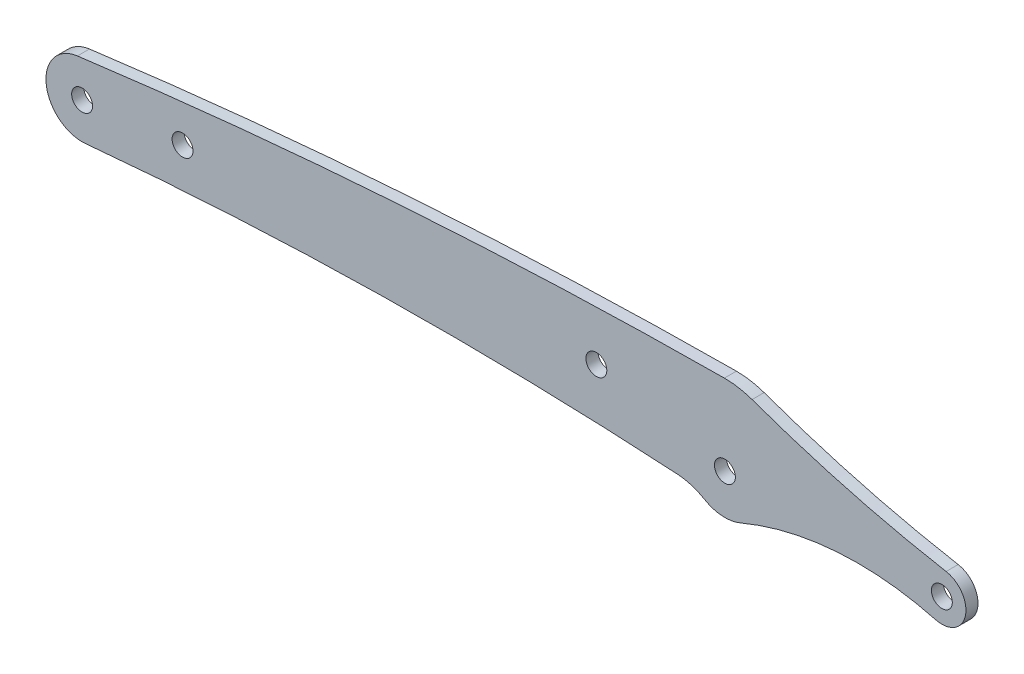
ISO-10303-21;
HEADER;
FILE_DESCRIPTION(('STEP AP214'),'2;1');
FILE_NAME('part.step','',(''),(''),'','','');
FILE_SCHEMA(('AUTOMOTIVE_DESIGN { 1 0 10303 214 1 1 1 1 }'));
ENDSEC;
DATA;
#1=APPLICATION_CONTEXT('core data for automotive mechanical design processes');
#2=APPLICATION_PROTOCOL_DEFINITION('international standard','automotive_design',2000,#1);
#3=PRODUCT_CONTEXT('',#1,'mechanical');
#4=PRODUCT('Part','Part','',(#3));
#5=PRODUCT_RELATED_PRODUCT_CATEGORY('part','',(#4));
#6=PRODUCT_DEFINITION_FORMATION('','',#4);
#7=PRODUCT_DEFINITION_CONTEXT('part definition',#1,'design');
#8=PRODUCT_DEFINITION('design','',#6,#7);
#9=PRODUCT_DEFINITION_SHAPE('','',#8);
#10=(LENGTH_UNIT() NAMED_UNIT(*) SI_UNIT(.MILLI.,.METRE.));
#11=(NAMED_UNIT(*) PLANE_ANGLE_UNIT() SI_UNIT($,.RADIAN.));
#12=(NAMED_UNIT(*) SI_UNIT($,.STERADIAN.) SOLID_ANGLE_UNIT());
#13=UNCERTAINTY_MEASURE_WITH_UNIT(LENGTH_MEASURE(1.E-05),#10,'distance_accuracy_value','');
#14=(GEOMETRIC_REPRESENTATION_CONTEXT(3) GLOBAL_UNCERTAINTY_ASSIGNED_CONTEXT((#13)) GLOBAL_UNIT_ASSIGNED_CONTEXT((#10,
#11,#12)) REPRESENTATION_CONTEXT('',''));
#15=CARTESIAN_POINT('',(0.,0.,0.));
#16=DIRECTION('',(0.,0.,1.));
#17=DIRECTION('',(1.,0.,0.));
#18=AXIS2_PLACEMENT_3D('',#15,#16,#17);
#19=CARTESIAN_POINT('',(-160.,0.,5.));
#20=DIRECTION('',(0.,0.,-1.));
#21=DIRECTION('',(-1.,0.,0.));
#22=AXIS2_PLACEMENT_3D('',#19,#20,#21);
#23=CYLINDRICAL_SURFACE('',#22,9.00000000000004);
#24=CARTESIAN_POINT('',(-160.,0.,3.));
#25=DIRECTION('',(0.,0.,-1.));
#26=DIRECTION('',(-1.,0.,0.));
#27=AXIS2_PLACEMENT_3D('',#24,#25,#26);
#28=CIRCLE('',#27,9.00000000000004);
#29=CARTESIAN_POINT('',(-161.173821165763,8.92312410934659,3.));
#30=VERTEX_POINT('',#29);
#31=CARTESIAN_POINT('',(-159.155370177268,-8.96027903932406,3.));
#32=VERTEX_POINT('',#31);
#33=EDGE_CURVE('E89',#30,#32,#28,.F.);
#34=ORIENTED_EDGE('',*,*,#33,.F.);
#35=DIRECTION('',(0.,0.,-1.));
#36=VECTOR('',#35,1.);
#37=CARTESIAN_POINT('',(-161.173821165763,8.92312410934659,5.));
#38=LINE('',#37,#36);
#39=CARTESIAN_POINT('',(-161.173821165763,8.92312410934673,0.));
#40=VERTEX_POINT('',#39);
#41=EDGE_CURVE('E113',#40,#30,#38,.F.);
#42=ORIENTED_EDGE('',*,*,#41,.F.);
#43=CARTESIAN_POINT('',(-160.,0.,0.));
#44=DIRECTION('',(0.,0.,-1.));
#45=DIRECTION('',(-1.,0.,0.));
#46=AXIS2_PLACEMENT_3D('',#43,#44,#45);
#47=CIRCLE('',#46,9.00000000000004);
#48=CARTESIAN_POINT('',(-159.155370177268,-8.96027903932406,0.));
#49=VERTEX_POINT('',#48);
#50=EDGE_CURVE('E83',#40,#49,#47,.F.);
#51=ORIENTED_EDGE('',*,*,#50,.T.);
#52=DIRECTION('',(0.,0.,-1.));
#53=VECTOR('',#52,1.);
#54=CARTESIAN_POINT('',(-159.155370177268,-8.96027903932406,5.));
#55=LINE('',#54,#53);
#56=EDGE_CURVE('E115',#49,#32,#55,.F.);
#57=ORIENTED_EDGE('',*,*,#56,.T.);
#58=EDGE_LOOP('',(#34,#42,#51,#57));
#59=FACE_BOUND('',#58,.T.);
#60=ADVANCED_FACE('F33',(#59),#23,.T.);
#61=CARTESIAN_POINT('',(-69.9999999999999,-954.767510967984,5.));
#62=DIRECTION('',(0.,0.,-1.));
#63=DIRECTION('',(-1.,0.,0.));
#64=AXIS2_PLACEMENT_3D('',#61,#62,#63);
#65=CYLINDRICAL_SURFACE('',#64,950.);
#66=DIRECTION('',(0.,0.,-1.));
#67=VECTOR('',#66,1.);
#68=CARTESIAN_POINT('',(-11.7980264080804,-6.55206589761137,5.));
#69=LINE('',#68,#67);
#70=CARTESIAN_POINT('',(-11.7980264080804,-6.55206589761137,0.));
#71=VERTEX_POINT('',#70);
#72=CARTESIAN_POINT('',(-11.7980264080804,-6.55206589761137,3.));
#73=VERTEX_POINT('',#72);
#74=EDGE_CURVE('E133',#71,#73,#69,.F.);
#75=ORIENTED_EDGE('',*,*,#74,.T.);
#76=CARTESIAN_POINT('',(-69.9999999999999,-954.767510967984,3.));
#77=DIRECTION('',(0.,0.,-1.));
#78=DIRECTION('',(-1.,0.,0.));
#79=AXIS2_PLACEMENT_3D('',#76,#77,#78);
#80=CIRCLE('',#79,950.);
#81=EDGE_CURVE('E93',#73,#32,#80,.F.);
#82=ORIENTED_EDGE('',*,*,#81,.T.);
#83=ORIENTED_EDGE('',*,*,#56,.F.);
#84=CARTESIAN_POINT('',(-69.9999999999999,-954.767510967984,0.));
#85=DIRECTION('',(0.,0.,-1.));
#86=DIRECTION('',(-1.,0.,0.));
#87=AXIS2_PLACEMENT_3D('',#84,#85,#86);
#88=CIRCLE('',#87,950.);
#89=EDGE_CURVE('E156',#49,#71,#88,.T.);
#90=ORIENTED_EDGE('',*,*,#89,.T.);
#91=EDGE_LOOP('',(#75,#82,#83,#90));
#92=FACE_BOUND('',#91,.T.);
#93=ADVANCED_FACE('F159',(#92),#65,.F.);
#94=CARTESIAN_POINT('',(-12.7170049384792,-21.523888714512,5.));
#95=DIRECTION('',(0.,0.,-1.));
#96=DIRECTION('',(-1.,0.,0.));
#97=AXIS2_PLACEMENT_3D('',#94,#95,#96);
#98=CYLINDRICAL_SURFACE('',#97,15.);
#99=DIRECTION('',(0.,0.,-1.));
#100=VECTOR('',#99,1.);
#101=CARTESIAN_POINT('',(-5.08680197539167,-8.6095554858048,5.));
#102=LINE('',#101,#100);
#103=CARTESIAN_POINT('',(-5.08680197539167,-8.6095554858048,3.));
#104=VERTEX_POINT('',#103);
#105=CARTESIAN_POINT('',(-5.08680197539167,-8.6095554858048,0.));
#106=VERTEX_POINT('',#105);
#107=EDGE_CURVE('E131',#104,#106,#102,.T.);
#108=ORIENTED_EDGE('',*,*,#107,.F.);
#109=CARTESIAN_POINT('',(-12.7170049384792,-21.523888714512,3.));
#110=DIRECTION('',(0.,0.,-1.));
#111=DIRECTION('',(-1.,0.,0.));
#112=AXIS2_PLACEMENT_3D('',#109,#110,#111);
#113=CIRCLE('',#112,15.);
#114=EDGE_CURVE('E168',#104,#73,#113,.F.);
#115=ORIENTED_EDGE('',*,*,#114,.T.);
#116=ORIENTED_EDGE('',*,*,#74,.F.);
#117=CARTESIAN_POINT('',(-12.7170049384792,-21.523888714512,0.));
#118=DIRECTION('',(0.,0.,-1.));
#119=DIRECTION('',(-1.,0.,0.));
#120=AXIS2_PLACEMENT_3D('',#117,#118,#119);
#121=CIRCLE('',#120,15.);
#122=EDGE_CURVE('E153',#71,#106,#121,.T.);
#123=ORIENTED_EDGE('',*,*,#122,.T.);
#124=EDGE_LOOP('',(#108,#115,#116,#123));
#125=FACE_BOUND('',#124,.T.);
#126=ADVANCED_FACE('F167',(#125),#98,.F.);
#127=CARTESIAN_POINT('',(0.,0.,5.));
#128=DIRECTION('',(0.,0.,-1.));
#129=DIRECTION('',(-1.,0.,0.));
#130=AXIS2_PLACEMENT_3D('',#127,#128,#129);
#131=CYLINDRICAL_SURFACE('',#130,10.);
#132=CARTESIAN_POINT('',(0.,0.,3.));
#133=DIRECTION('',(0.,0.,-1.));
#134=DIRECTION('',(-1.,0.,0.));
#135=AXIS2_PLACEMENT_3D('',#132,#133,#134);
#136=CIRCLE('',#135,10.);
#137=CARTESIAN_POINT('',(3.89978213507625,-9.20824083628029,3.));
#138=VERTEX_POINT('',#137);
#139=EDGE_CURVE('E170',#104,#138,#136,.F.);
#140=ORIENTED_EDGE('',*,*,#139,.F.);
#141=ORIENTED_EDGE('',*,*,#107,.T.);
#142=CARTESIAN_POINT('',(0.,0.,0.));
#143=DIRECTION('',(0.,0.,-1.));
#144=DIRECTION('',(-1.,0.,0.));
#145=AXIS2_PLACEMENT_3D('',#142,#143,#144);
#146=CIRCLE('',#145,10.);
#147=CARTESIAN_POINT('',(3.89978213507625,-9.20824083628029,0.));
#148=VERTEX_POINT('',#147);
#149=EDGE_CURVE('E150',#106,#148,#146,.F.);
#150=ORIENTED_EDGE('',*,*,#149,.T.);
#151=DIRECTION('',(0.,0.,-1.));
#152=VECTOR('',#151,1.);
#153=CARTESIAN_POINT('',(3.89978213507625,-9.20824083628029,5.));
#154=LINE('',#153,#152);
#155=EDGE_CURVE('E128',#148,#138,#154,.F.);
#156=ORIENTED_EDGE('',*,*,#155,.T.);
#157=EDGE_LOOP('',(#140,#141,#150,#156));
#158=FACE_BOUND('',#157,.T.);
#159=ADVANCED_FACE('F270',(#158),#131,.T.);
#160=CARTESIAN_POINT('',(33.1481481481481,-78.2700471083825,5.));
#161=DIRECTION('',(0.,0.,-1.));
#162=DIRECTION('',(-1.,0.,0.));
#163=AXIS2_PLACEMENT_3D('',#160,#161,#162);
#164=CYLINDRICAL_SURFACE('',#163,75.);
#165=DIRECTION('',(0.,0.,-1.));
#166=VECTOR('',#165,1.);
#167=CARTESIAN_POINT('',(52.4554183813443,-5.79778126728759,5.));
#168=LINE('',#167,#166);
#169=CARTESIAN_POINT('',(52.4554183813443,-5.79778126728759,3.));
#170=VERTEX_POINT('',#169);
#171=CARTESIAN_POINT('',(52.4554183813443,-5.7977812672876,0.));
#172=VERTEX_POINT('',#171);
#173=EDGE_CURVE('E126',#170,#172,#168,.T.);
#174=ORIENTED_EDGE('',*,*,#173,.F.);
#175=CARTESIAN_POINT('',(33.1481481481481,-78.2700471083825,3.));
#176=DIRECTION('',(0.,0.,-1.));
#177=DIRECTION('',(-1.,0.,0.));
#178=AXIS2_PLACEMENT_3D('',#175,#176,#177);
#179=CIRCLE('',#178,75.);
#180=EDGE_CURVE('E173',#170,#138,#179,.F.);
#181=ORIENTED_EDGE('',*,*,#180,.T.);
#182=ORIENTED_EDGE('',*,*,#155,.F.);
#183=CARTESIAN_POINT('',(33.1481481481481,-78.2700471083825,0.));
#184=DIRECTION('',(0.,0.,-1.));
#185=DIRECTION('',(-1.,0.,0.));
#186=AXIS2_PLACEMENT_3D('',#183,#184,#185);
#187=CIRCLE('',#186,75.);
#188=EDGE_CURVE('E147',#148,#172,#187,.T.);
#189=ORIENTED_EDGE('',*,*,#188,.T.);
#190=EDGE_LOOP('',(#174,#181,#182,#189));
#191=FACE_BOUND('',#190,.T.);
#192=ADVANCED_FACE('F266',(#191),#164,.F.);
#193=CARTESIAN_POINT('',(54.,0.,5.));
#194=DIRECTION('',(0.,0.,-1.));
#195=DIRECTION('',(-1.,0.,0.));
#196=AXIS2_PLACEMENT_3D('',#193,#194,#195);
#197=CYLINDRICAL_SURFACE('',#196,6.);
#198=CARTESIAN_POINT('',(54.,0.,3.));
#199=DIRECTION('',(0.,0.,-1.));
#200=DIRECTION('',(-1.,0.,0.));
#201=AXIS2_PLACEMENT_3D('',#198,#199,#200);
#202=CIRCLE('',#201,6.);
#203=CARTESIAN_POINT('',(55.0617283950617,5.90531394721055,3.));
#204=VERTEX_POINT('',#203);
#205=EDGE_CURVE('E178',#170,#204,#202,.F.);
#206=ORIENTED_EDGE('',*,*,#205,.F.);
#207=ORIENTED_EDGE('',*,*,#173,.T.);
#208=CARTESIAN_POINT('',(54.,0.,0.));
#209=DIRECTION('',(0.,0.,-1.));
#210=DIRECTION('',(-1.,0.,0.));
#211=AXIS2_PLACEMENT_3D('',#208,#209,#210);
#212=CIRCLE('',#211,6.);
#213=CARTESIAN_POINT('',(55.0617283950617,5.90531394721055,0.));
#214=VERTEX_POINT('',#213);
#215=EDGE_CURVE('E144',#172,#214,#212,.F.);
#216=ORIENTED_EDGE('',*,*,#215,.T.);
#217=DIRECTION('',(0.,0.,-1.));
#218=VECTOR('',#217,1.);
#219=CARTESIAN_POINT('',(55.0617283950617,5.90531394721055,5.));
#220=LINE('',#219,#218);
#221=EDGE_CURVE('E121',#214,#204,#220,.F.);
#222=ORIENTED_EDGE('',*,*,#221,.T.);
#223=EDGE_LOOP('',(#206,#207,#216,#222));
#224=FACE_BOUND('',#223,.T.);
#225=ADVANCED_FACE('F262',(#224),#197,.T.);
#226=CARTESIAN_POINT('',(108.148148148148,301.171011307739,5.));
#227=DIRECTION('',(0.,0.,-1.));
#228=DIRECTION('',(-1.,0.,0.));
#229=AXIS2_PLACEMENT_3D('',#226,#227,#228);
#230=CYLINDRICAL_SURFACE('',#229,300.);
#231=DIRECTION('',(0.,0.,-1.));
#232=VECTOR('',#231,1.);
#233=CARTESIAN_POINT('',(6.75925925925919,18.8231882067337,5.));
#234=LINE('',#233,#232);
#235=CARTESIAN_POINT('',(6.75925925925923,18.8231882067337,3.));
#236=VERTEX_POINT('',#235);
#237=CARTESIAN_POINT('',(6.75925925925923,18.8231882067337,0.));
#238=VERTEX_POINT('',#237);
#239=EDGE_CURVE('E118',#236,#238,#234,.T.);
#240=ORIENTED_EDGE('',*,*,#239,.F.);
#241=CARTESIAN_POINT('',(108.148148148148,301.171011307739,3.));
#242=DIRECTION('',(0.,0.,-1.));
#243=DIRECTION('',(-1.,0.,0.));
#244=AXIS2_PLACEMENT_3D('',#241,#242,#243);
#245=CIRCLE('',#244,300.);
#246=EDGE_CURVE('E180',#236,#204,#245,.F.);
#247=ORIENTED_EDGE('',*,*,#246,.T.);
#248=ORIENTED_EDGE('',*,*,#221,.F.);
#249=CARTESIAN_POINT('',(108.148148148148,301.171011307739,0.));
#250=DIRECTION('',(0.,0.,-1.));
#251=DIRECTION('',(-1.,0.,0.));
#252=AXIS2_PLACEMENT_3D('',#249,#250,#251);
#253=CIRCLE('',#252,300.);
#254=EDGE_CURVE('E141',#214,#238,#253,.T.);
#255=ORIENTED_EDGE('',*,*,#254,.T.);
#256=EDGE_LOOP('',(#240,#247,#248,#255));
#257=FACE_BOUND('',#256,.T.);
#258=ADVANCED_FACE('F258',(#257),#230,.F.);
#259=CARTESIAN_POINT('',(0.,0.,5.));
#260=DIRECTION('',(0.,0.,-1.));
#261=DIRECTION('',(-1.,0.,0.));
#262=AXIS2_PLACEMENT_3D('',#259,#260,#261);
#263=CYLINDRICAL_SURFACE('',#262,20.);
#264=CARTESIAN_POINT('',(0.,0.,3.));
#265=DIRECTION('',(0.,0.,-1.));
#266=DIRECTION('',(-1.,0.,0.));
#267=AXIS2_PLACEMENT_3D('',#264,#265,#266);
#268=CIRCLE('',#267,20.);
#269=CARTESIAN_POINT('',(-0.130908203124971,19.9995715714698,3.));
#270=VERTEX_POINT('',#269);
#271=EDGE_CURVE('E46',#236,#270,#268,.F.);
#272=ORIENTED_EDGE('',*,*,#271,.F.);
#273=ORIENTED_EDGE('',*,*,#239,.T.);
#274=CARTESIAN_POINT('',(0.,0.,0.));
#275=DIRECTION('',(0.,0.,-1.));
#276=DIRECTION('',(-1.,0.,0.));
#277=AXIS2_PLACEMENT_3D('',#274,#275,#276);
#278=CIRCLE('',#277,20.);
#279=CARTESIAN_POINT('',(-0.13090820312499,19.9995715714698,0.));
#280=VERTEX_POINT('',#279);
#281=EDGE_CURVE('E138',#238,#280,#278,.F.);
#282=ORIENTED_EDGE('',*,*,#281,.T.);
#283=DIRECTION('',(0.,0.,-1.));
#284=VECTOR('',#283,1.);
#285=CARTESIAN_POINT('',(-0.130908203124971,19.9995715714698,5.));
#286=LINE('',#285,#284);
#287=EDGE_CURVE('E54',#270,#280,#286,.T.);
#288=ORIENTED_EDGE('',*,*,#287,.F.);
#289=EDGE_LOOP('',(#272,#273,#282,#288));
#290=FACE_BOUND('',#289,.T.);
#291=ADVANCED_FACE('F253',(#290),#263,.T.);
#292=CARTESIAN_POINT('',(8.37812500000069,-1279.97258057409,5.));
#293=DIRECTION('',(0.,0.,-1.));
#294=DIRECTION('',(-1.,0.,0.));
#295=AXIS2_PLACEMENT_3D('',#292,#293,#294);
#296=CYLINDRICAL_SURFACE('',#295,1300.);
#297=CARTESIAN_POINT('',(8.37812500000069,-1279.97258057409,3.));
#298=DIRECTION('',(0.,0.,-1.));
#299=DIRECTION('',(-1.,0.,0.));
#300=AXIS2_PLACEMENT_3D('',#297,#298,#299);
#301=CIRCLE('',#300,1300.);
#302=EDGE_CURVE('E11',#270,#30,#301,.F.);
#303=ORIENTED_EDGE('',*,*,#302,.F.);
#304=ORIENTED_EDGE('',*,*,#287,.T.);
#305=CARTESIAN_POINT('',(8.37812500000069,-1279.97258057409,0.));
#306=DIRECTION('',(0.,0.,-1.));
#307=DIRECTION('',(-1.,0.,0.));
#308=AXIS2_PLACEMENT_3D('',#305,#306,#307);
#309=CIRCLE('',#308,1300.);
#310=EDGE_CURVE('E40',#280,#40,#309,.F.);
#311=ORIENTED_EDGE('',*,*,#310,.T.);
#312=ORIENTED_EDGE('',*,*,#41,.T.);
#313=EDGE_LOOP('',(#303,#304,#311,#312));
#314=FACE_BOUND('',#313,.T.);
#315=ADVANCED_FACE('F117',(#314),#296,.T.);
#316=CARTESIAN_POINT('',(-75.8109374999997,-639.986290287043,0.));
#317=DIRECTION('',(0.,0.,1.));
#318=DIRECTION('',(1.,0.,0.));
#319=AXIS2_PLACEMENT_3D('',#316,#317,#318);
#320=PLANE('',#319);
#321=CARTESIAN_POINT('',(-135.,2.8,0.));
#322=DIRECTION('',(0.,0.,1.));
#323=DIRECTION('',(1.,0.,0.));
#324=AXIS2_PLACEMENT_3D('',#321,#322,#323);
#325=CIRCLE('',#324,2.59999999999999);
#326=CARTESIAN_POINT('',(-132.4,2.8,0.));
#327=VERTEX_POINT('',#326);
#328=EDGE_CURVE('E188',#327,#327,#325,.T.);
#329=ORIENTED_EDGE('',*,*,#328,.T.);
#330=EDGE_LOOP('',(#329));
#331=FACE_BOUND('',#330,.T.);
#332=CARTESIAN_POINT('',(-32.,7.,0.));
#333=DIRECTION('',(0.,0.,1.));
#334=DIRECTION('',(1.,0.,0.));
#335=AXIS2_PLACEMENT_3D('',#332,#333,#334);
#336=CIRCLE('',#335,2.6);
#337=CARTESIAN_POINT('',(-29.4,7.,0.));
#338=VERTEX_POINT('',#337);
#339=EDGE_CURVE('E206',#338,#338,#336,.T.);
#340=ORIENTED_EDGE('',*,*,#339,.T.);
#341=EDGE_LOOP('',(#340));
#342=FACE_BOUND('',#341,.T.);
#343=CARTESIAN_POINT('',(0.,0.,0.));
#344=DIRECTION('',(0.,0.,1.));
#345=DIRECTION('',(1.,0.,0.));
#346=AXIS2_PLACEMENT_3D('',#343,#344,#345);
#347=CIRCLE('',#346,2.6);
#348=CARTESIAN_POINT('',(2.6,0.,0.));
#349=VERTEX_POINT('',#348);
#350=EDGE_CURVE('E200',#349,#349,#347,.T.);
#351=ORIENTED_EDGE('',*,*,#350,.T.);
#352=EDGE_LOOP('',(#351));
#353=FACE_BOUND('',#352,.T.);
#354=CARTESIAN_POINT('',(54.,0.,0.));
#355=DIRECTION('',(0.,0.,1.));
#356=DIRECTION('',(1.,0.,0.));
#357=AXIS2_PLACEMENT_3D('',#354,#355,#356);
#358=CIRCLE('',#357,2.6);
#359=CARTESIAN_POINT('',(56.6,0.,0.));
#360=VERTEX_POINT('',#359);
#361=EDGE_CURVE('E194',#360,#360,#358,.T.);
#362=ORIENTED_EDGE('',*,*,#361,.T.);
#363=EDGE_LOOP('',(#362));
#364=FACE_BOUND('',#363,.T.);
#365=CARTESIAN_POINT('',(-160.,0.,0.));
#366=DIRECTION('',(0.,0.,1.));
#367=DIRECTION('',(1.,0.,0.));
#368=AXIS2_PLACEMENT_3D('',#365,#366,#367);
#369=CIRCLE('',#368,2.59999999999999);
#370=CARTESIAN_POINT('',(-157.4,0.,0.));
#371=VERTEX_POINT('',#370);
#372=EDGE_CURVE('E184',#371,#371,#369,.T.);
#373=ORIENTED_EDGE('',*,*,#372,.T.);
#374=EDGE_LOOP('',(#373));
#375=FACE_BOUND('',#374,.T.);
#376=ORIENTED_EDGE('',*,*,#281,.F.);
#377=ORIENTED_EDGE('',*,*,#254,.F.);
#378=ORIENTED_EDGE('',*,*,#215,.F.);
#379=ORIENTED_EDGE('',*,*,#188,.F.);
#380=ORIENTED_EDGE('',*,*,#149,.F.);
#381=ORIENTED_EDGE('',*,*,#122,.F.);
#382=ORIENTED_EDGE('',*,*,#89,.F.);
#383=ORIENTED_EDGE('',*,*,#50,.F.);
#384=ORIENTED_EDGE('',*,*,#310,.F.);
#385=EDGE_LOOP('',(#376,#377,#378,#379,#380,#381,#382,#383,#384));
#386=FACE_BOUND('',#385,.T.);
#387=ADVANCED_FACE('F162',(#331,#342,#353,#364,#375,#386),#320,.F.);
#388=CARTESIAN_POINT('',(0.,0.,3.));
#389=DIRECTION('',(0.,0.,-1.));
#390=DIRECTION('',(-1.,0.,0.));
#391=AXIS2_PLACEMENT_3D('',#388,#389,#390);
#392=PLANE('',#391);
#393=CARTESIAN_POINT('',(-135.,2.8,3.));
#394=DIRECTION('',(0.,0.,1.));
#395=DIRECTION('',(1.,0.,0.));
#396=AXIS2_PLACEMENT_3D('',#393,#394,#395);
#397=CIRCLE('',#396,2.59999999999999);
#398=CARTESIAN_POINT('',(-132.4,2.8,3.));
#399=VERTEX_POINT('',#398);
#400=EDGE_CURVE('E209',#399,#399,#397,.T.);
#401=ORIENTED_EDGE('',*,*,#400,.F.);
#402=EDGE_LOOP('',(#401));
#403=FACE_BOUND('',#402,.T.);
#404=CARTESIAN_POINT('',(-32.,7.,3.));
#405=DIRECTION('',(0.,0.,1.));
#406=DIRECTION('',(1.,0.,0.));
#407=AXIS2_PLACEMENT_3D('',#404,#405,#406);
#408=CIRCLE('',#407,2.6);
#409=CARTESIAN_POINT('',(-29.4,7.,3.));
#410=VERTEX_POINT('',#409);
#411=EDGE_CURVE('E203',#410,#410,#408,.T.);
#412=ORIENTED_EDGE('',*,*,#411,.F.);
#413=EDGE_LOOP('',(#412));
#414=FACE_BOUND('',#413,.T.);
#415=CARTESIAN_POINT('',(0.,0.,3.));
#416=DIRECTION('',(0.,0.,1.));
#417=DIRECTION('',(1.,0.,0.));
#418=AXIS2_PLACEMENT_3D('',#415,#416,#417);
#419=CIRCLE('',#418,2.6);
#420=CARTESIAN_POINT('',(2.6,0.,3.));
#421=VERTEX_POINT('',#420);
#422=EDGE_CURVE('E197',#421,#421,#419,.T.);
#423=ORIENTED_EDGE('',*,*,#422,.F.);
#424=EDGE_LOOP('',(#423));
#425=FACE_BOUND('',#424,.T.);
#426=CARTESIAN_POINT('',(54.,0.,3.));
#427=DIRECTION('',(0.,0.,1.));
#428=DIRECTION('',(1.,0.,0.));
#429=AXIS2_PLACEMENT_3D('',#426,#427,#428);
#430=CIRCLE('',#429,2.6);
#431=CARTESIAN_POINT('',(56.6,0.,3.));
#432=VERTEX_POINT('',#431);
#433=EDGE_CURVE('E191',#432,#432,#430,.T.);
#434=ORIENTED_EDGE('',*,*,#433,.F.);
#435=EDGE_LOOP('',(#434));
#436=FACE_BOUND('',#435,.T.);
#437=CARTESIAN_POINT('',(-160.,0.,3.));
#438=DIRECTION('',(0.,0.,1.));
#439=DIRECTION('',(1.,0.,0.));
#440=AXIS2_PLACEMENT_3D('',#437,#438,#439);
#441=CIRCLE('',#440,2.59999999999999);
#442=CARTESIAN_POINT('',(-157.4,0.,3.));
#443=VERTEX_POINT('',#442);
#444=EDGE_CURVE('E185',#443,#443,#441,.T.);
#445=ORIENTED_EDGE('',*,*,#444,.F.);
#446=EDGE_LOOP('',(#445));
#447=FACE_BOUND('',#446,.T.);
#448=ORIENTED_EDGE('',*,*,#33,.T.);
#449=ORIENTED_EDGE('',*,*,#81,.F.);
#450=ORIENTED_EDGE('',*,*,#114,.F.);
#451=ORIENTED_EDGE('',*,*,#139,.T.);
#452=ORIENTED_EDGE('',*,*,#180,.F.);
#453=ORIENTED_EDGE('',*,*,#205,.T.);
#454=ORIENTED_EDGE('',*,*,#246,.F.);
#455=ORIENTED_EDGE('',*,*,#271,.T.);
#456=ORIENTED_EDGE('',*,*,#302,.T.);
#457=EDGE_LOOP('',(#448,#449,#450,#451,#452,#453,#454,#455,#456));
#458=FACE_BOUND('',#457,.T.);
#459=ADVANCED_FACE('F109',(#403,#414,#425,#436,#447,#458),#392,.F.);
#460=CARTESIAN_POINT('',(-160.,0.,0.));
#461=DIRECTION('',(0.,0.,1.));
#462=DIRECTION('',(1.,0.,0.));
#463=AXIS2_PLACEMENT_3D('',#460,#461,#462);
#464=CYLINDRICAL_SURFACE('',#463,2.59999999999999);
#465=ORIENTED_EDGE('',*,*,#372,.F.);
#466=EDGE_LOOP('',(#465));
#467=FACE_BOUND('',#466,.T.);
#468=ORIENTED_EDGE('',*,*,#444,.T.);
#469=EDGE_LOOP('',(#468));
#470=FACE_BOUND('',#469,.T.);
#471=ADVANCED_FACE('F226',(#467,#470),#464,.F.);
#472=CARTESIAN_POINT('',(54.,0.,0.));
#473=DIRECTION('',(0.,0.,1.));
#474=DIRECTION('',(1.,0.,0.));
#475=AXIS2_PLACEMENT_3D('',#472,#473,#474);
#476=CYLINDRICAL_SURFACE('',#475,2.6);
#477=ORIENTED_EDGE('',*,*,#361,.F.);
#478=EDGE_LOOP('',(#477));
#479=FACE_BOUND('',#478,.T.);
#480=ORIENTED_EDGE('',*,*,#433,.T.);
#481=EDGE_LOOP('',(#480));
#482=FACE_BOUND('',#481,.T.);
#483=ADVANCED_FACE('F237',(#479,#482),#476,.F.);
#484=CARTESIAN_POINT('',(0.,0.,0.));
#485=DIRECTION('',(0.,0.,1.));
#486=DIRECTION('',(1.,0.,0.));
#487=AXIS2_PLACEMENT_3D('',#484,#485,#486);
#488=CYLINDRICAL_SURFACE('',#487,2.6);
#489=ORIENTED_EDGE('',*,*,#350,.F.);
#490=EDGE_LOOP('',(#489));
#491=FACE_BOUND('',#490,.T.);
#492=ORIENTED_EDGE('',*,*,#422,.T.);
#493=EDGE_LOOP('',(#492));
#494=FACE_BOUND('',#493,.T.);
#495=ADVANCED_FACE('F243',(#491,#494),#488,.F.);
#496=CARTESIAN_POINT('',(-32.,7.,0.));
#497=DIRECTION('',(0.,0.,1.));
#498=DIRECTION('',(1.,0.,0.));
#499=AXIS2_PLACEMENT_3D('',#496,#497,#498);
#500=CYLINDRICAL_SURFACE('',#499,2.6);
#501=ORIENTED_EDGE('',*,*,#339,.F.);
#502=EDGE_LOOP('',(#501));
#503=FACE_BOUND('',#502,.T.);
#504=ORIENTED_EDGE('',*,*,#411,.T.);
#505=EDGE_LOOP('',(#504));
#506=FACE_BOUND('',#505,.T.);
#507=ADVANCED_FACE('F220',(#503,#506),#500,.F.);
#508=CARTESIAN_POINT('',(-135.,2.8,0.));
#509=DIRECTION('',(0.,0.,1.));
#510=DIRECTION('',(1.,0.,0.));
#511=AXIS2_PLACEMENT_3D('',#508,#509,#510);
#512=CYLINDRICAL_SURFACE('',#511,2.59999999999999);
#513=ORIENTED_EDGE('',*,*,#328,.F.);
#514=EDGE_LOOP('',(#513));
#515=FACE_BOUND('',#514,.T.);
#516=ORIENTED_EDGE('',*,*,#400,.T.);
#517=EDGE_LOOP('',(#516));
#518=FACE_BOUND('',#517,.T.);
#519=ADVANCED_FACE('F217',(#515,#518),#512,.F.);
#520=CLOSED_SHELL('',(#60,#93,#126,#159,#192,#225,#258,#291,#315,#387,#459,#471,#483,#495,#507,#519));
#521=MANIFOLD_SOLID_BREP('B2',#520);
#522=ADVANCED_BREP_SHAPE_REPRESENTATION('',(#18,#521),#14);
#523=SHAPE_DEFINITION_REPRESENTATION(#9,#522);
ENDSEC;
END-ISO-10303-21;
